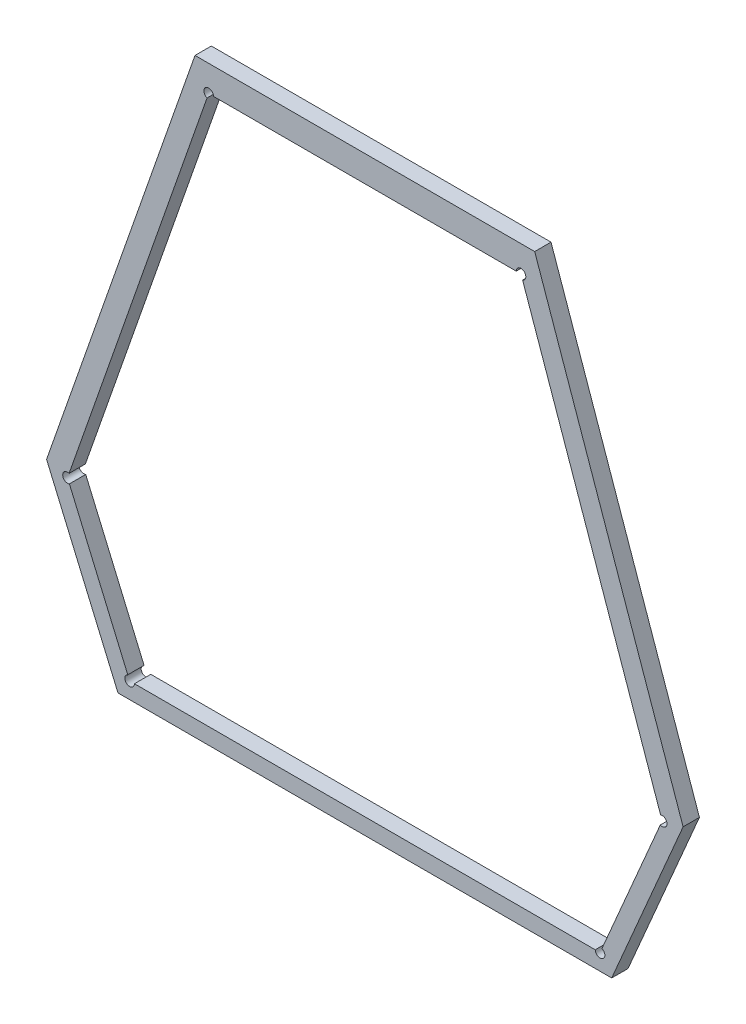
ISO-10303-21;
HEADER;
FILE_DESCRIPTION(('STEP AP214'),'2;1');
FILE_NAME('part.step','',(''),(''),'','','');
FILE_SCHEMA(('AUTOMOTIVE_DESIGN { 1 0 10303 214 1 1 1 1 }'));
ENDSEC;
DATA;
#1=APPLICATION_CONTEXT('core data for automotive mechanical design processes');
#2=APPLICATION_PROTOCOL_DEFINITION('international standard','automotive_design',2000,#1);
#3=PRODUCT_CONTEXT('',#1,'mechanical');
#4=PRODUCT('Part','Part','',(#3));
#5=PRODUCT_RELATED_PRODUCT_CATEGORY('part','',(#4));
#6=PRODUCT_DEFINITION_FORMATION('','',#4);
#7=PRODUCT_DEFINITION_CONTEXT('part definition',#1,'design');
#8=PRODUCT_DEFINITION('design','',#6,#7);
#9=PRODUCT_DEFINITION_SHAPE('','',#8);
#10=(LENGTH_UNIT() NAMED_UNIT(*) SI_UNIT(.MILLI.,.METRE.));
#11=(NAMED_UNIT(*) PLANE_ANGLE_UNIT() SI_UNIT($,.RADIAN.));
#12=(NAMED_UNIT(*) SI_UNIT($,.STERADIAN.) SOLID_ANGLE_UNIT());
#13=UNCERTAINTY_MEASURE_WITH_UNIT(LENGTH_MEASURE(1.E-05),#10,'distance_accuracy_value','');
#14=(GEOMETRIC_REPRESENTATION_CONTEXT(3) GLOBAL_UNCERTAINTY_ASSIGNED_CONTEXT((#13)) GLOBAL_UNIT_ASSIGNED_CONTEXT((#10,
#11,#12)) REPRESENTATION_CONTEXT('',''));
#15=CARTESIAN_POINT('',(0.,0.,0.));
#16=DIRECTION('',(0.,0.,1.));
#17=DIRECTION('',(1.,0.,0.));
#18=AXIS2_PLACEMENT_3D('',#15,#16,#17);
#19=CARTESIAN_POINT('',(-1.34299335690274,-1.32409422554966,0.0042));
#20=DIRECTION('',(0.,0.,1.));
#21=DIRECTION('',(1.,0.,0.));
#22=AXIS2_PLACEMENT_3D('',#19,#20,#21);
#23=PLANE('',#22);
#24=DIRECTION('',(-1.,0.,0.));
#25=VECTOR('',#24,1.);
#26=CARTESIAN_POINT('',(-1.30761173859859,-1.25785167756798,0.0042));
#27=LINE('',#26,#25);
#28=CARTESIAN_POINT('',(-1.30761173859859,-1.25785167756798,0.0042));
#29=VERTEX_POINT('',#28);
#30=CARTESIAN_POINT('',(-1.37837497520689,-1.25785167756798,0.0042));
#31=VERTEX_POINT('',#30);
#32=EDGE_CURVE('E11',#29,#31,#27,.T.);
#33=ORIENTED_EDGE('',*,*,#32,.T.);
#34=DIRECTION('',(-0.330395456277157,-0.943842594118007,0.));
#35=VECTOR('',#34,1.);
#36=CARTESIAN_POINT('',(-1.37837497520689,-1.25785167756798,0.0042));
#37=LINE('',#36,#35);
#38=CARTESIAN_POINT('',(-1.40929378240433,-1.34617761134773,0.0042));
#39=VERTEX_POINT('',#38);
#40=EDGE_CURVE('E155',#31,#39,#37,.T.);
#41=ORIENTED_EDGE('',*,*,#40,.T.);
#42=DIRECTION('',(0.393910865008933,-0.919148644359504,0.));
#43=VECTOR('',#42,1.);
#44=CARTESIAN_POINT('',(-1.40929378240433,-1.34617761134773,0.0042));
#45=LINE('',#44,#43);
#46=CARTESIAN_POINT('',(-1.39441807028819,-1.38088848591353,0.0042));
#47=VERTEX_POINT('',#46);
#48=EDGE_CURVE('E257',#39,#47,#45,.T.);
#49=ORIENTED_EDGE('',*,*,#48,.T.);
#50=DIRECTION('',(1.,0.,0.));
#51=VECTOR('',#50,1.);
#52=CARTESIAN_POINT('',(-1.39441807028819,-1.38088848591353,0.0042));
#53=LINE('',#52,#51);
#54=CARTESIAN_POINT('',(-1.29156864351729,-1.38088848591353,0.0042));
#55=VERTEX_POINT('',#54);
#56=EDGE_CURVE('E244',#47,#55,#53,.T.);
#57=ORIENTED_EDGE('',*,*,#56,.T.);
#58=DIRECTION('',(0.393910865008935,0.919148644359503,0.));
#59=VECTOR('',#58,1.);
#60=CARTESIAN_POINT('',(-1.29156864351729,-1.38088848591353,0.0042));
#61=LINE('',#60,#59);
#62=CARTESIAN_POINT('',(-1.27669293140115,-1.34617761134773,0.0042));
#63=VERTEX_POINT('',#62);
#64=EDGE_CURVE('E227',#55,#63,#61,.T.);
#65=ORIENTED_EDGE('',*,*,#64,.T.);
#66=DIRECTION('',(-0.33039545627716,0.943842594118006,0.));
#67=VECTOR('',#66,1.);
#68=CARTESIAN_POINT('',(-1.27669293140115,-1.34617761134773,0.0042));
#69=LINE('',#68,#67);
#70=EDGE_CURVE('E213',#63,#29,#69,.T.);
#71=ORIENTED_EDGE('',*,*,#70,.T.);
#72=EDGE_LOOP('',(#33,#41,#49,#57,#65,#71));
#73=FACE_BOUND('',#72,.T.);
#74=DIRECTION('',(-1.,0.,0.));
#75=VECTOR('',#74,1.);
#76=CARTESIAN_POINT('',(-1.29499771700044,-1.37750986813174,0.0042));
#77=LINE('',#76,#75);
#78=CARTESIAN_POINT('',(-1.29499771700044,-1.37750986813174,0.0042));
#79=VERTEX_POINT('',#78);
#80=CARTESIAN_POINT('',(-1.39098899680504,-1.37750986813174,0.0042));
#81=VERTEX_POINT('',#80);
#82=EDGE_CURVE('E264',#79,#81,#77,.T.);
#83=ORIENTED_EDGE('',*,*,#82,.T.);
#84=CARTESIAN_POINT('',(-1.39198899680504,-1.37750986813174,0.0042));
#85=DIRECTION('',(0.,0.,-1.));
#86=DIRECTION('',(1.,0.,0.));
#87=AXIS2_PLACEMENT_3D('',#84,#85,#86);
#88=CIRCLE('',#87,0.000999999999999994);
#89=CARTESIAN_POINT('',(-1.39238290767005,-1.37659071948738,0.0042));
#90=VERTEX_POINT('',#89);
#91=EDGE_CURVE('E255',#81,#90,#88,.T.);
#92=ORIENTED_EDGE('',*,*,#91,.T.);
#93=DIRECTION('',(-0.393910865008935,0.919148644359503,0.));
#94=VECTOR('',#93,1.);
#95=CARTESIAN_POINT('',(-1.39238290767005,-1.37659071948738,0.0042));
#96=LINE('',#95,#94);
#97=CARTESIAN_POINT('',(-1.40453767281776,-1.34822888207584,0.0042));
#98=VERTEX_POINT('',#97);
#99=EDGE_CURVE('E241',#90,#98,#96,.T.);
#100=ORIENTED_EDGE('',*,*,#99,.T.);
#101=CARTESIAN_POINT('',(-1.40493158368277,-1.34730973343148,0.0042));
#102=DIRECTION('',(0.,0.,-1.));
#103=DIRECTION('',(0.393910865009542,-0.919148644359243,0.));
#104=AXIS2_PLACEMENT_3D('',#101,#102,#103);
#105=CIRCLE('',#104,0.000999999999999988);
#106=CARTESIAN_POINT('',(-1.40460118822649,-1.34636589083736,0.0042));
#107=VERTEX_POINT('',#106);
#108=EDGE_CURVE('E249',#98,#107,#105,.T.);
#109=ORIENTED_EDGE('',*,*,#108,.T.);
#110=DIRECTION('',(0.330395456277162,0.943842594118005,0.));
#111=VECTOR('',#110,1.);
#112=CARTESIAN_POINT('',(-1.40460118822649,-1.34636589083736,0.0042));
#113=LINE('',#112,#111);
#114=CARTESIAN_POINT('',(-1.37585836060447,-1.2642560903857,0.0042));
#115=VERTEX_POINT('',#114);
#116=EDGE_CURVE('E210',#107,#115,#113,.T.);
#117=ORIENTED_EDGE('',*,*,#116,.T.);
#118=CARTESIAN_POINT('',(-1.37552796514819,-1.26331224779158,0.0042));
#119=DIRECTION('',(0.,0.,-1.));
#120=DIRECTION('',(-0.330395456279023,-0.943842594117354,0.));
#121=AXIS2_PLACEMENT_3D('',#118,#119,#120);
#122=CIRCLE('',#121,0.00100000000000001);
#123=CARTESIAN_POINT('',(-1.37452796514819,-1.26331224779158,0.0042));
#124=VERTEX_POINT('',#123);
#125=EDGE_CURVE('E221',#115,#124,#122,.T.);
#126=ORIENTED_EDGE('',*,*,#125,.T.);
#127=DIRECTION('',(1.,0.,0.));
#128=VECTOR('',#127,1.);
#129=CARTESIAN_POINT('',(-1.37452796514819,-1.26331224779158,0.0042));
#130=LINE('',#129,#128);
#131=CARTESIAN_POINT('',(-1.31145874865729,-1.26331224779158,0.0042));
#132=VERTEX_POINT('',#131);
#133=EDGE_CURVE('E186',#124,#132,#130,.T.);
#134=ORIENTED_EDGE('',*,*,#133,.T.);
#135=CARTESIAN_POINT('',(-1.31045874865729,-1.26331224779158,0.0042));
#136=DIRECTION('',(0.,0.,-1.));
#137=DIRECTION('',(-1.,0.,0.));
#138=AXIS2_PLACEMENT_3D('',#135,#136,#137);
#139=CIRCLE('',#138,0.00100000000000001);
#140=CARTESIAN_POINT('',(-1.31012835320101,-1.2642560903857,0.0042));
#141=VERTEX_POINT('',#140);
#142=EDGE_CURVE('E198',#132,#141,#139,.T.);
#143=ORIENTED_EDGE('',*,*,#142,.T.);
#144=DIRECTION('',(0.330395456277155,-0.943842594118008,0.));
#145=VECTOR('',#144,1.);
#146=CARTESIAN_POINT('',(-1.31012835320101,-1.2642560903857,0.0042));
#147=LINE('',#146,#145);
#148=CARTESIAN_POINT('',(-1.28138552557899,-1.34636589083736,0.0042));
#149=VERTEX_POINT('',#148);
#150=EDGE_CURVE('E176',#141,#149,#147,.T.);
#151=ORIENTED_EDGE('',*,*,#150,.T.);
#152=CARTESIAN_POINT('',(-1.28105513012271,-1.34730973343148,0.0042));
#153=DIRECTION('',(0.,0.,-1.));
#154=DIRECTION('',(-0.330395456279023,0.943842594117354,0.));
#155=AXIS2_PLACEMENT_3D('',#152,#153,#154);
#156=CIRCLE('',#155,0.000999999999999999);
#157=CARTESIAN_POINT('',(-1.28144904098772,-1.34822888207584,0.0042));
#158=VERTEX_POINT('',#157);
#159=EDGE_CURVE('E179',#149,#158,#156,.T.);
#160=ORIENTED_EDGE('',*,*,#159,.T.);
#161=DIRECTION('',(-0.393910865008941,-0.919148644359501,0.));
#162=VECTOR('',#161,1.);
#163=CARTESIAN_POINT('',(-1.28144904098772,-1.34822888207584,0.0042));
#164=LINE('',#163,#162);
#165=CARTESIAN_POINT('',(-1.29360380613543,-1.37659071948738,0.0042));
#166=VERTEX_POINT('',#165);
#167=EDGE_CURVE('E271',#158,#166,#164,.T.);
#168=ORIENTED_EDGE('',*,*,#167,.T.);
#169=CARTESIAN_POINT('',(-1.29399771700044,-1.37750986813174,0.0042));
#170=DIRECTION('',(0.,0.,-1.));
#171=DIRECTION('',(0.39391086500973,0.919148644359163,0.));
#172=AXIS2_PLACEMENT_3D('',#169,#170,#171);
#173=CIRCLE('',#172,0.00100000000000001);
#174=EDGE_CURVE('E229',#166,#79,#173,.T.);
#175=ORIENTED_EDGE('',*,*,#174,.T.);
#176=EDGE_LOOP('',(#83,#92,#100,#109,#117,#126,#134,#143,#151,#160,#168,#175));
#177=FACE_BOUND('',#176,.T.);
#178=ADVANCED_FACE('F17',(#73,#177),#23,.T.);
#179=CARTESIAN_POINT('',(-1.29399771700044,-1.37750986813174,0.0012));
#180=DIRECTION('',(0.,0.,1.));
#181=DIRECTION('',(0.550494838754667,-0.834838566732799,0.));
#182=AXIS2_PLACEMENT_3D('',#179,#180,#181);
#183=CYLINDRICAL_SURFACE('',#182,0.00100000000000001);
#184=DIRECTION('',(0.,0.,1.));
#185=VECTOR('',#184,1.);
#186=CARTESIAN_POINT('',(-1.29360380613543,-1.37659071948738,0.0008));
#187=LINE('',#186,#185);
#188=CARTESIAN_POINT('',(-1.29360380613543,-1.37659071948738,0.0008));
#189=VERTEX_POINT('',#188);
#190=EDGE_CURVE('E24',#189,#166,#187,.T.);
#191=ORIENTED_EDGE('',*,*,#190,.F.);
#192=CARTESIAN_POINT('',(-1.29399771700044,-1.37750986813174,0.0008));
#193=DIRECTION('',(0.,0.,1.));
#194=DIRECTION('',(-1.,0.,0.));
#195=AXIS2_PLACEMENT_3D('',#192,#193,#194);
#196=CIRCLE('',#195,0.00100000000000001);
#197=CARTESIAN_POINT('',(-1.29499771700044,-1.37750986813174,0.0008));
#198=VERTEX_POINT('',#197);
#199=EDGE_CURVE('E259',#198,#189,#196,.T.);
#200=ORIENTED_EDGE('',*,*,#199,.F.);
#201=DIRECTION('',(0.,0.,-1.));
#202=VECTOR('',#201,1.);
#203=CARTESIAN_POINT('',(-1.29499771700044,-1.37750986813174,0.0042));
#204=LINE('',#203,#202);
#205=EDGE_CURVE('E246',#79,#198,#204,.T.);
#206=ORIENTED_EDGE('',*,*,#205,.F.);
#207=ORIENTED_EDGE('',*,*,#174,.F.);
#208=EDGE_LOOP('',(#191,#200,#206,#207));
#209=FACE_BOUND('',#208,.T.);
#210=ADVANCED_FACE('F325',(#209),#183,.F.);
#211=CARTESIAN_POINT('',(-1.40493158368277,-1.34730973343148,0.0012));
#212=DIRECTION('',(0.,0.,1.));
#213=DIRECTION('',(-1.,0.,0.));
#214=AXIS2_PLACEMENT_3D('',#211,#212,#213);
#215=CYLINDRICAL_SURFACE('',#214,0.000999999999999988);
#216=DIRECTION('',(0.,0.,-1.));
#217=VECTOR('',#216,1.);
#218=CARTESIAN_POINT('',(-1.40460118822649,-1.34636589083736,0.0042));
#219=LINE('',#218,#217);
#220=CARTESIAN_POINT('',(-1.40460118822649,-1.34636589083736,0.0008));
#221=VERTEX_POINT('',#220);
#222=EDGE_CURVE('E261',#107,#221,#219,.T.);
#223=ORIENTED_EDGE('',*,*,#222,.F.);
#224=ORIENTED_EDGE('',*,*,#108,.F.);
#225=DIRECTION('',(0.,0.,1.));
#226=VECTOR('',#225,1.);
#227=CARTESIAN_POINT('',(-1.40453767281776,-1.34822888207584,0.0008));
#228=LINE('',#227,#226);
#229=CARTESIAN_POINT('',(-1.40453767281776,-1.34822888207584,0.0008));
#230=VERTEX_POINT('',#229);
#231=EDGE_CURVE('E232',#230,#98,#228,.T.);
#232=ORIENTED_EDGE('',*,*,#231,.F.);
#233=CARTESIAN_POINT('',(-1.40493158368277,-1.34730973343148,0.0008));
#234=DIRECTION('',(0.,0.,1.));
#235=DIRECTION('',(0.330395456279023,0.943842594117354,0.));
#236=AXIS2_PLACEMENT_3D('',#233,#234,#235);
#237=CIRCLE('',#236,0.000999999999999988);
#238=EDGE_CURVE('E215',#221,#230,#237,.T.);
#239=ORIENTED_EDGE('',*,*,#238,.F.);
#240=EDGE_LOOP('',(#223,#224,#232,#239));
#241=FACE_BOUND('',#240,.T.);
#242=ADVANCED_FACE('F329',(#241),#215,.F.);
#243=CARTESIAN_POINT('',(-1.31045874865729,-1.26331224779158,0.0012));
#244=DIRECTION('',(0.,0.,1.));
#245=DIRECTION('',(0.578621008831681,0.815596547404786,0.));
#246=AXIS2_PLACEMENT_3D('',#243,#244,#245);
#247=CYLINDRICAL_SURFACE('',#246,0.00100000000000001);
#248=DIRECTION('',(0.,0.,1.));
#249=VECTOR('',#248,1.);
#250=CARTESIAN_POINT('',(-1.31145874865729,-1.26331224779158,0.0008));
#251=LINE('',#250,#249);
#252=CARTESIAN_POINT('',(-1.31145874865729,-1.26331224779158,0.0008));
#253=VERTEX_POINT('',#252);
#254=EDGE_CURVE('E252',#253,#132,#251,.T.);
#255=ORIENTED_EDGE('',*,*,#254,.F.);
#256=CARTESIAN_POINT('',(-1.31045874865729,-1.26331224779158,0.0008));
#257=DIRECTION('',(0.,0.,1.));
#258=DIRECTION('',(0.33039545627922,-0.943842594117285,0.));
#259=AXIS2_PLACEMENT_3D('',#256,#257,#258);
#260=CIRCLE('',#259,0.00100000000000001);
#261=CARTESIAN_POINT('',(-1.31012835320101,-1.2642560903857,0.0008));
#262=VERTEX_POINT('',#261);
#263=EDGE_CURVE('E235',#262,#253,#260,.T.);
#264=ORIENTED_EDGE('',*,*,#263,.F.);
#265=DIRECTION('',(0.,0.,-1.));
#266=VECTOR('',#265,1.);
#267=CARTESIAN_POINT('',(-1.31012835320101,-1.2642560903857,0.0042));
#268=LINE('',#267,#266);
#269=EDGE_CURVE('E218',#141,#262,#268,.T.);
#270=ORIENTED_EDGE('',*,*,#269,.F.);
#271=ORIENTED_EDGE('',*,*,#142,.F.);
#272=EDGE_LOOP('',(#255,#264,#270,#271));
#273=FACE_BOUND('',#272,.T.);
#274=ADVANCED_FACE('F333',(#273),#247,.F.);
#275=CARTESIAN_POINT('',(-1.37552796514819,-1.26331224779158,0.0012));
#276=DIRECTION('',(0.,0.,1.));
#277=DIRECTION('',(-1.,0.,0.));
#278=AXIS2_PLACEMENT_3D('',#275,#276,#277);
#279=CYLINDRICAL_SURFACE('',#278,0.00100000000000001);
#280=DIRECTION('',(0.,0.,-1.));
#281=VECTOR('',#280,1.);
#282=CARTESIAN_POINT('',(-1.37452796514819,-1.26331224779158,0.0042));
#283=LINE('',#282,#281);
#284=CARTESIAN_POINT('',(-1.37452796514819,-1.26331224779158,0.0008));
#285=VERTEX_POINT('',#284);
#286=EDGE_CURVE('E238',#124,#285,#283,.T.);
#287=ORIENTED_EDGE('',*,*,#286,.F.);
#288=ORIENTED_EDGE('',*,*,#125,.F.);
#289=DIRECTION('',(0.,0.,1.));
#290=VECTOR('',#289,1.);
#291=CARTESIAN_POINT('',(-1.37585836060447,-1.2642560903857,0.0008));
#292=LINE('',#291,#290);
#293=CARTESIAN_POINT('',(-1.37585836060447,-1.2642560903857,0.0008));
#294=VERTEX_POINT('',#293);
#295=EDGE_CURVE('E201',#294,#115,#292,.T.);
#296=ORIENTED_EDGE('',*,*,#295,.F.);
#297=CARTESIAN_POINT('',(-1.37552796514819,-1.26331224779158,0.0008));
#298=DIRECTION('',(0.,0.,1.));
#299=DIRECTION('',(1.,0.,0.));
#300=AXIS2_PLACEMENT_3D('',#297,#298,#299);
#301=CIRCLE('',#300,0.00100000000000001);
#302=EDGE_CURVE('E189',#285,#294,#301,.T.);
#303=ORIENTED_EDGE('',*,*,#302,.F.);
#304=EDGE_LOOP('',(#287,#288,#296,#303));
#305=FACE_BOUND('',#304,.T.);
#306=ADVANCED_FACE('F350',(#305),#279,.F.);
#307=CARTESIAN_POINT('',(-1.39198899680504,-1.37750986813174,0.0012));
#308=DIRECTION('',(0.,0.,1.));
#309=DIRECTION('',(-1.,0.,0.));
#310=AXIS2_PLACEMENT_3D('',#307,#308,#309);
#311=CYLINDRICAL_SURFACE('',#310,0.000999999999999994);
#312=DIRECTION('',(0.,0.,1.));
#313=VECTOR('',#312,1.);
#314=CARTESIAN_POINT('',(-1.39098899680504,-1.37750986813174,0.0008));
#315=LINE('',#314,#313);
#316=CARTESIAN_POINT('',(-1.39098899680504,-1.37750986813174,0.0008));
#317=VERTEX_POINT('',#316);
#318=EDGE_CURVE('E224',#317,#81,#315,.T.);
#319=ORIENTED_EDGE('',*,*,#318,.F.);
#320=CARTESIAN_POINT('',(-1.39198899680504,-1.37750986813174,0.0008));
#321=DIRECTION('',(0.,0.,1.));
#322=DIRECTION('',(-0.39391086500973,0.919148644359163,0.));
#323=AXIS2_PLACEMENT_3D('',#320,#321,#322);
#324=CIRCLE('',#323,0.000999999999999994);
#325=CARTESIAN_POINT('',(-1.39238290767005,-1.37659071948738,0.0008));
#326=VERTEX_POINT('',#325);
#327=EDGE_CURVE('E204',#326,#317,#324,.T.);
#328=ORIENTED_EDGE('',*,*,#327,.F.);
#329=DIRECTION('',(0.,0.,1.));
#330=VECTOR('',#329,1.);
#331=CARTESIAN_POINT('',(-1.39238290767005,-1.37659071948738,0.0008));
#332=LINE('',#331,#330);
#333=EDGE_CURVE('E192',#326,#90,#332,.T.);
#334=ORIENTED_EDGE('',*,*,#333,.T.);
#335=ORIENTED_EDGE('',*,*,#91,.F.);
#336=EDGE_LOOP('',(#319,#328,#334,#335));
#337=FACE_BOUND('',#336,.T.);
#338=ADVANCED_FACE('F359',(#337),#311,.F.);
#339=CARTESIAN_POINT('',(-1.28105513012271,-1.34730973343148,0.0012));
#340=DIRECTION('',(0.,0.,1.));
#341=DIRECTION('',(0.99941933162449,-0.0340734438420653,0.));
#342=AXIS2_PLACEMENT_3D('',#339,#340,#341);
#343=CYLINDRICAL_SURFACE('',#342,0.000999999999999999);
#344=DIRECTION('',(0.,0.,1.));
#345=VECTOR('',#344,1.);
#346=CARTESIAN_POINT('',(-1.28138552557899,-1.34636589083736,0.0008));
#347=LINE('',#346,#345);
#348=CARTESIAN_POINT('',(-1.28138552557899,-1.34636589083736,0.0008));
#349=VERTEX_POINT('',#348);
#350=EDGE_CURVE('E207',#349,#149,#347,.T.);
#351=ORIENTED_EDGE('',*,*,#350,.F.);
#352=CARTESIAN_POINT('',(-1.28105513012271,-1.34730973343148,0.0008));
#353=DIRECTION('',(0.,0.,1.));
#354=DIRECTION('',(-0.393910865009542,-0.919148644359243,0.));
#355=AXIS2_PLACEMENT_3D('',#352,#353,#354);
#356=CIRCLE('',#355,0.000999999999999999);
#357=CARTESIAN_POINT('',(-1.28144904098772,-1.34822888207584,0.0008));
#358=VERTEX_POINT('',#357);
#359=EDGE_CURVE('E195',#358,#349,#356,.T.);
#360=ORIENTED_EDGE('',*,*,#359,.F.);
#361=DIRECTION('',(0.,0.,-1.));
#362=VECTOR('',#361,1.);
#363=CARTESIAN_POINT('',(-1.28144904098772,-1.34822888207584,0.0042));
#364=LINE('',#363,#362);
#365=EDGE_CURVE('E147',#158,#358,#364,.T.);
#366=ORIENTED_EDGE('',*,*,#365,.F.);
#367=ORIENTED_EDGE('',*,*,#159,.F.);
#368=EDGE_LOOP('',(#351,#360,#366,#367));
#369=FACE_BOUND('',#368,.T.);
#370=ADVANCED_FACE('F362',(#369),#343,.F.);
#371=CARTESIAN_POINT('',(-1.40493158368277,-1.34730973343148,0.0008));
#372=DIRECTION('',(-0.919148644359501,-0.393910865008941,0.));
#373=DIRECTION('',(0.393910865008941,-0.919148644359501,0.));
#374=AXIS2_PLACEMENT_3D('',#371,#372,#373);
#375=PLANE('',#374);
#376=ORIENTED_EDGE('',*,*,#231,.T.);
#377=ORIENTED_EDGE('',*,*,#99,.F.);
#378=ORIENTED_EDGE('',*,*,#333,.F.);
#379=DIRECTION('',(0.393910865008935,-0.919148644359503,0.));
#380=VECTOR('',#379,1.);
#381=CARTESIAN_POINT('',(-1.40453767281776,-1.34822888207584,0.0008));
#382=LINE('',#381,#380);
#383=EDGE_CURVE('E164',#230,#326,#382,.T.);
#384=ORIENTED_EDGE('',*,*,#383,.F.);
#385=EDGE_LOOP('',(#376,#377,#378,#384));
#386=FACE_BOUND('',#385,.T.);
#387=ADVANCED_FACE('F346',(#386),#375,.F.);
#388=CARTESIAN_POINT('',(-1.29399771700044,-1.37750986813174,0.0008));
#389=DIRECTION('',(0.,1.,0.));
#390=DIRECTION('',(-1.,0.,0.));
#391=AXIS2_PLACEMENT_3D('',#388,#389,#390);
#392=PLANE('',#391);
#393=ORIENTED_EDGE('',*,*,#205,.T.);
#394=DIRECTION('',(-1.,0.,0.));
#395=VECTOR('',#394,1.);
#396=CARTESIAN_POINT('',(-1.29499771700044,-1.37750986813174,0.0008));
#397=LINE('',#396,#395);
#398=EDGE_CURVE('E148',#198,#317,#397,.T.);
#399=ORIENTED_EDGE('',*,*,#398,.T.);
#400=ORIENTED_EDGE('',*,*,#318,.T.);
#401=ORIENTED_EDGE('',*,*,#82,.F.);
#402=EDGE_LOOP('',(#393,#399,#400,#401));
#403=FACE_BOUND('',#402,.T.);
#404=ADVANCED_FACE('F343',(#403),#392,.T.);
#405=CARTESIAN_POINT('',(-1.30422547619298,-1.32424824056129,0.0008));
#406=DIRECTION('',(0.,0.,1.));
#407=DIRECTION('',(1.,0.,0.));
#408=AXIS2_PLACEMENT_3D('',#405,#406,#407);
#409=PLANE('',#408);
#410=DIRECTION('',(-1.,0.,0.));
#411=VECTOR('',#410,1.);
#412=CARTESIAN_POINT('',(-1.30761173859859,-1.25785167756798,0.0008));
#413=LINE('',#412,#411);
#414=CARTESIAN_POINT('',(-1.30761173859859,-1.25785167756798,0.0008));
#415=VERTEX_POINT('',#414);
#416=CARTESIAN_POINT('',(-1.37837497520689,-1.25785167756798,0.0008));
#417=VERTEX_POINT('',#416);
#418=EDGE_CURVE('E138',#415,#417,#413,.T.);
#419=ORIENTED_EDGE('',*,*,#418,.F.);
#420=DIRECTION('',(-0.33039545627716,0.943842594118006,0.));
#421=VECTOR('',#420,1.);
#422=CARTESIAN_POINT('',(-1.27669293140115,-1.34617761134773,0.0008));
#423=LINE('',#422,#421);
#424=CARTESIAN_POINT('',(-1.27669293140115,-1.34617761134773,0.0008));
#425=VERTEX_POINT('',#424);
#426=EDGE_CURVE('E168',#425,#415,#423,.T.);
#427=ORIENTED_EDGE('',*,*,#426,.F.);
#428=DIRECTION('',(0.39391086500894,0.919148644359501,0.));
#429=VECTOR('',#428,1.);
#430=CARTESIAN_POINT('',(-1.29156864351729,-1.38088848591353,0.0008));
#431=LINE('',#430,#429);
#432=CARTESIAN_POINT('',(-1.29156864351729,-1.38088848591353,0.0008));
#433=VERTEX_POINT('',#432);
#434=EDGE_CURVE('E171',#433,#425,#431,.T.);
#435=ORIENTED_EDGE('',*,*,#434,.F.);
#436=DIRECTION('',(-1.,0.,0.));
#437=VECTOR('',#436,1.);
#438=CARTESIAN_POINT('',(-1.29156864351729,-1.38088848591353,0.0008));
#439=LINE('',#438,#437);
#440=CARTESIAN_POINT('',(-1.39441807028819,-1.38088848591353,0.0008));
#441=VERTEX_POINT('',#440);
#442=EDGE_CURVE('E281',#433,#441,#439,.T.);
#443=ORIENTED_EDGE('',*,*,#442,.T.);
#444=DIRECTION('',(-0.393910865008945,0.919148644359499,0.));
#445=VECTOR('',#444,1.);
#446=CARTESIAN_POINT('',(-1.39441807028819,-1.38088848591353,0.0008));
#447=LINE('',#446,#445);
#448=CARTESIAN_POINT('',(-1.40929378240433,-1.34617761134773,0.0008));
#449=VERTEX_POINT('',#448);
#450=EDGE_CURVE('E162',#441,#449,#447,.T.);
#451=ORIENTED_EDGE('',*,*,#450,.T.);
#452=DIRECTION('',(0.33039545627716,0.943842594118006,0.));
#453=VECTOR('',#452,1.);
#454=CARTESIAN_POINT('',(-1.40929378240433,-1.34617761134773,0.0008));
#455=LINE('',#454,#453);
#456=EDGE_CURVE('E153',#449,#417,#455,.T.);
#457=ORIENTED_EDGE('',*,*,#456,.T.);
#458=EDGE_LOOP('',(#419,#427,#435,#443,#451,#457));
#459=FACE_BOUND('',#458,.T.);
#460=ORIENTED_EDGE('',*,*,#199,.T.);
#461=DIRECTION('',(-0.393910865008947,-0.919148644359498,0.));
#462=VECTOR('',#461,1.);
#463=CARTESIAN_POINT('',(-1.28144904098772,-1.34822888207584,0.0008));
#464=LINE('',#463,#462);
#465=EDGE_CURVE('E273',#358,#189,#464,.T.);
#466=ORIENTED_EDGE('',*,*,#465,.F.);
#467=ORIENTED_EDGE('',*,*,#359,.T.);
#468=DIRECTION('',(0.330395456277161,-0.943842594118006,0.));
#469=VECTOR('',#468,1.);
#470=CARTESIAN_POINT('',(-1.31012835320101,-1.2642560903857,0.0008));
#471=LINE('',#470,#469);
#472=EDGE_CURVE('E165',#262,#349,#471,.T.);
#473=ORIENTED_EDGE('',*,*,#472,.F.);
#474=ORIENTED_EDGE('',*,*,#263,.T.);
#475=DIRECTION('',(1.,0.,0.));
#476=VECTOR('',#475,1.);
#477=CARTESIAN_POINT('',(-1.37452796514819,-1.26331224779158,0.0008));
#478=LINE('',#477,#476);
#479=EDGE_CURVE('E157',#285,#253,#478,.T.);
#480=ORIENTED_EDGE('',*,*,#479,.F.);
#481=ORIENTED_EDGE('',*,*,#302,.T.);
#482=DIRECTION('',(-0.33039545627716,-0.943842594118006,0.));
#483=VECTOR('',#482,1.);
#484=CARTESIAN_POINT('',(-1.37585836060447,-1.2642560903857,0.0008));
#485=LINE('',#484,#483);
#486=EDGE_CURVE('E156',#294,#221,#485,.T.);
#487=ORIENTED_EDGE('',*,*,#486,.T.);
#488=ORIENTED_EDGE('',*,*,#238,.T.);
#489=ORIENTED_EDGE('',*,*,#383,.T.);
#490=ORIENTED_EDGE('',*,*,#327,.T.);
#491=ORIENTED_EDGE('',*,*,#398,.F.);
#492=EDGE_LOOP('',(#460,#466,#467,#473,#474,#480,#481,#487,#488,#489,#490,#491));
#493=FACE_BOUND('',#492,.T.);
#494=ADVANCED_FACE('F159',(#459,#493),#409,.F.);
#495=CARTESIAN_POINT('',(-1.31045874865729,-1.26331224779158,0.0008));
#496=DIRECTION('',(-0.943842594118006,-0.330395456277161,0.));
#497=DIRECTION('',(0.330395456277161,-0.943842594118006,0.));
#498=AXIS2_PLACEMENT_3D('',#495,#496,#497);
#499=PLANE('',#498);
#500=ORIENTED_EDGE('',*,*,#269,.T.);
#501=ORIENTED_EDGE('',*,*,#472,.T.);
#502=ORIENTED_EDGE('',*,*,#350,.T.);
#503=ORIENTED_EDGE('',*,*,#150,.F.);
#504=EDGE_LOOP('',(#500,#501,#502,#503));
#505=FACE_BOUND('',#504,.T.);
#506=ADVANCED_FACE('F342',(#505),#499,.T.);
#507=CARTESIAN_POINT('',(-1.40929378240433,-1.34617761134773,0.0008));
#508=DIRECTION('',(0.943842594118006,-0.33039545627716,0.));
#509=DIRECTION('',(0.33039545627716,0.943842594118006,0.));
#510=AXIS2_PLACEMENT_3D('',#507,#508,#509);
#511=PLANE('',#510);
#512=ORIENTED_EDGE('',*,*,#456,.F.);
#513=DIRECTION('',(0.,0.,1.));
#514=VECTOR('',#513,1.);
#515=CARTESIAN_POINT('',(-1.40929378240433,-1.34617761134773,0.0008));
#516=LINE('',#515,#514);
#517=EDGE_CURVE('E279',#449,#39,#516,.T.);
#518=ORIENTED_EDGE('',*,*,#517,.T.);
#519=ORIENTED_EDGE('',*,*,#40,.F.);
#520=DIRECTION('',(0.,0.,1.));
#521=VECTOR('',#520,1.);
#522=CARTESIAN_POINT('',(-1.37837497520689,-1.25785167756798,0.0008));
#523=LINE('',#522,#521);
#524=EDGE_CURVE('E141',#417,#31,#523,.T.);
#525=ORIENTED_EDGE('',*,*,#524,.F.);
#526=EDGE_LOOP('',(#512,#518,#519,#525));
#527=FACE_BOUND('',#526,.T.);
#528=ADVANCED_FACE('F151',(#527),#511,.F.);
#529=CARTESIAN_POINT('',(-1.39441807028819,-1.38088848591353,0.0008));
#530=DIRECTION('',(0.919148644359501,0.393910865008941,0.));
#531=DIRECTION('',(-0.393910865008941,0.919148644359501,0.));
#532=AXIS2_PLACEMENT_3D('',#529,#530,#531);
#533=PLANE('',#532);
#534=ORIENTED_EDGE('',*,*,#450,.F.);
#535=DIRECTION('',(0.,0.,1.));
#536=VECTOR('',#535,1.);
#537=CARTESIAN_POINT('',(-1.39441807028819,-1.38088848591353,0.0008));
#538=LINE('',#537,#536);
#539=EDGE_CURVE('E283',#441,#47,#538,.T.);
#540=ORIENTED_EDGE('',*,*,#539,.T.);
#541=ORIENTED_EDGE('',*,*,#48,.F.);
#542=ORIENTED_EDGE('',*,*,#517,.F.);
#543=EDGE_LOOP('',(#534,#540,#541,#542));
#544=FACE_BOUND('',#543,.T.);
#545=ADVANCED_FACE('F310',(#544),#533,.F.);
#546=CARTESIAN_POINT('',(-1.37552796514819,-1.26331224779158,0.0008));
#547=DIRECTION('',(-0.943842594118006,0.330395456277161,0.));
#548=DIRECTION('',(-0.330395456277161,-0.943842594118006,0.));
#549=AXIS2_PLACEMENT_3D('',#546,#547,#548);
#550=PLANE('',#549);
#551=ORIENTED_EDGE('',*,*,#222,.T.);
#552=ORIENTED_EDGE('',*,*,#486,.F.);
#553=ORIENTED_EDGE('',*,*,#295,.T.);
#554=ORIENTED_EDGE('',*,*,#116,.F.);
#555=EDGE_LOOP('',(#551,#552,#553,#554));
#556=FACE_BOUND('',#555,.T.);
#557=ADVANCED_FACE('F321',(#556),#550,.F.);
#558=CARTESIAN_POINT('',(-1.30761173859859,-1.25785167756798,0.0008));
#559=DIRECTION('',(0.,1.,0.));
#560=DIRECTION('',(-1.,0.,0.));
#561=AXIS2_PLACEMENT_3D('',#558,#559,#560);
#562=PLANE('',#561);
#563=ORIENTED_EDGE('',*,*,#418,.T.);
#564=ORIENTED_EDGE('',*,*,#524,.T.);
#565=ORIENTED_EDGE('',*,*,#32,.F.);
#566=DIRECTION('',(0.,0.,1.));
#567=VECTOR('',#566,1.);
#568=CARTESIAN_POINT('',(-1.30761173859859,-1.25785167756798,0.0008));
#569=LINE('',#568,#567);
#570=EDGE_CURVE('E143',#415,#29,#569,.T.);
#571=ORIENTED_EDGE('',*,*,#570,.F.);
#572=EDGE_LOOP('',(#563,#564,#565,#571));
#573=FACE_BOUND('',#572,.T.);
#574=ADVANCED_FACE('F140',(#573),#562,.T.);
#575=CARTESIAN_POINT('',(-1.27669293140115,-1.34617761134773,0.0008));
#576=DIRECTION('',(0.943842594118006,0.33039545627716,0.));
#577=DIRECTION('',(-0.33039545627716,0.943842594118006,0.));
#578=AXIS2_PLACEMENT_3D('',#575,#576,#577);
#579=PLANE('',#578);
#580=ORIENTED_EDGE('',*,*,#426,.T.);
#581=ORIENTED_EDGE('',*,*,#570,.T.);
#582=ORIENTED_EDGE('',*,*,#70,.F.);
#583=DIRECTION('',(0.,0.,1.));
#584=VECTOR('',#583,1.);
#585=CARTESIAN_POINT('',(-1.27669293140115,-1.34617761134773,0.0008));
#586=LINE('',#585,#584);
#587=EDGE_CURVE('E291',#425,#63,#586,.T.);
#588=ORIENTED_EDGE('',*,*,#587,.F.);
#589=EDGE_LOOP('',(#580,#581,#582,#588));
#590=FACE_BOUND('',#589,.T.);
#591=ADVANCED_FACE('F312',(#590),#579,.T.);
#592=CARTESIAN_POINT('',(-1.29156864351729,-1.38088848591353,0.0008));
#593=DIRECTION('',(0.919148644359501,-0.393910865008941,0.));
#594=DIRECTION('',(0.393910865008941,0.919148644359501,0.));
#595=AXIS2_PLACEMENT_3D('',#592,#593,#594);
#596=PLANE('',#595);
#597=ORIENTED_EDGE('',*,*,#434,.T.);
#598=ORIENTED_EDGE('',*,*,#587,.T.);
#599=ORIENTED_EDGE('',*,*,#64,.F.);
#600=DIRECTION('',(0.,0.,1.));
#601=VECTOR('',#600,1.);
#602=CARTESIAN_POINT('',(-1.29156864351729,-1.38088848591353,0.0008));
#603=LINE('',#602,#601);
#604=EDGE_CURVE('E294',#433,#55,#603,.T.);
#605=ORIENTED_EDGE('',*,*,#604,.F.);
#606=EDGE_LOOP('',(#597,#598,#599,#605));
#607=FACE_BOUND('',#606,.T.);
#608=ADVANCED_FACE('F304',(#607),#596,.T.);
#609=CARTESIAN_POINT('',(-1.34299335690274,-1.38088848591353,0.0008));
#610=DIRECTION('',(0.,-1.,0.));
#611=DIRECTION('',(1.,0.,0.));
#612=AXIS2_PLACEMENT_3D('',#609,#610,#611);
#613=PLANE('',#612);
#614=ORIENTED_EDGE('',*,*,#442,.F.);
#615=ORIENTED_EDGE('',*,*,#604,.T.);
#616=ORIENTED_EDGE('',*,*,#56,.F.);
#617=ORIENTED_EDGE('',*,*,#539,.F.);
#618=EDGE_LOOP('',(#614,#615,#616,#617));
#619=FACE_BOUND('',#618,.T.);
#620=ADVANCED_FACE('F301',(#619),#613,.T.);
#621=CARTESIAN_POINT('',(-1.28105513012271,-1.34730973343148,0.0008));
#622=DIRECTION('',(-0.919148644359501,0.393910865008941,0.));
#623=DIRECTION('',(-0.393910865008941,-0.919148644359501,0.));
#624=AXIS2_PLACEMENT_3D('',#621,#622,#623);
#625=PLANE('',#624);
#626=ORIENTED_EDGE('',*,*,#190,.T.);
#627=ORIENTED_EDGE('',*,*,#167,.F.);
#628=ORIENTED_EDGE('',*,*,#365,.T.);
#629=ORIENTED_EDGE('',*,*,#465,.T.);
#630=EDGE_LOOP('',(#626,#627,#628,#629));
#631=FACE_BOUND('',#630,.T.);
#632=ADVANCED_FACE('F269',(#631),#625,.T.);
#633=CARTESIAN_POINT('',(-1.34299335690274,-1.26331224779158,0.0008));
#634=DIRECTION('',(0.,-1.,0.));
#635=DIRECTION('',(1.,0.,0.));
#636=AXIS2_PLACEMENT_3D('',#633,#634,#635);
#637=PLANE('',#636);
#638=ORIENTED_EDGE('',*,*,#254,.T.);
#639=ORIENTED_EDGE('',*,*,#133,.F.);
#640=ORIENTED_EDGE('',*,*,#286,.T.);
#641=ORIENTED_EDGE('',*,*,#479,.T.);
#642=EDGE_LOOP('',(#638,#639,#640,#641));
#643=FACE_BOUND('',#642,.T.);
#644=ADVANCED_FACE('F339',(#643),#637,.T.);
#645=CLOSED_SHELL('',(#178,#210,#242,#274,#306,#338,#370,#387,#404,#494,#506,#528,#545,#557,
#574,#591,#608,#620,#632,#644));
#646=MANIFOLD_SOLID_BREP('B1',#645);
#647=ADVANCED_BREP_SHAPE_REPRESENTATION('',(#18,#646),#14);
#648=SHAPE_DEFINITION_REPRESENTATION(#9,#647);
ENDSEC;
END-ISO-10303-21;
